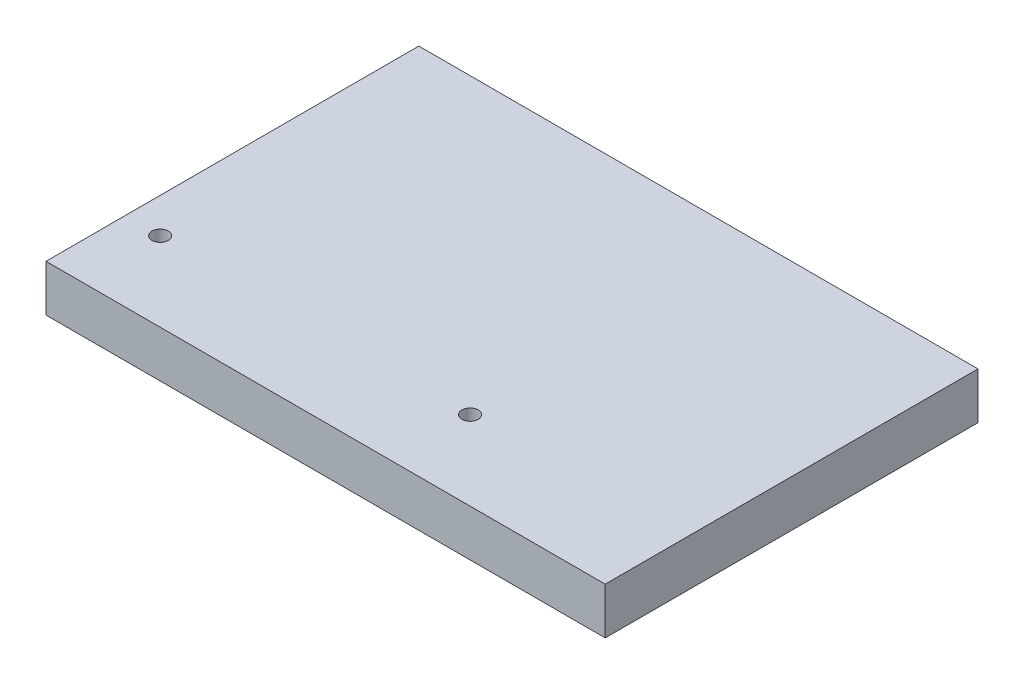
ISO-10303-21;
HEADER;
FILE_DESCRIPTION(('STEP AP214'),'2;1');
FILE_NAME('part.step','',(''),(''),'','','');
FILE_SCHEMA(('AUTOMOTIVE_DESIGN { 1 0 10303 214 1 1 1 1 }'));
ENDSEC;
DATA;
#1=APPLICATION_CONTEXT('core data for automotive mechanical design processes');
#2=APPLICATION_PROTOCOL_DEFINITION('international standard','automotive_design',2000,#1);
#3=PRODUCT_CONTEXT('',#1,'mechanical');
#4=PRODUCT('Part','Part','',(#3));
#5=PRODUCT_RELATED_PRODUCT_CATEGORY('part','',(#4));
#6=PRODUCT_DEFINITION_FORMATION('','',#4);
#7=PRODUCT_DEFINITION_CONTEXT('part definition',#1,'design');
#8=PRODUCT_DEFINITION('design','',#6,#7);
#9=PRODUCT_DEFINITION_SHAPE('','',#8);
#10=(LENGTH_UNIT() NAMED_UNIT(*) SI_UNIT(.MILLI.,.METRE.));
#11=(NAMED_UNIT(*) PLANE_ANGLE_UNIT() SI_UNIT($,.RADIAN.));
#12=(NAMED_UNIT(*) SI_UNIT($,.STERADIAN.) SOLID_ANGLE_UNIT());
#13=UNCERTAINTY_MEASURE_WITH_UNIT(LENGTH_MEASURE(1.E-05),#10,'distance_accuracy_value','');
#14=(GEOMETRIC_REPRESENTATION_CONTEXT(3) GLOBAL_UNCERTAINTY_ASSIGNED_CONTEXT((#13)) GLOBAL_UNIT_ASSIGNED_CONTEXT((#10,
#11,#12)) REPRESENTATION_CONTEXT('',''));
#15=CARTESIAN_POINT('',(0.,0.,0.));
#16=DIRECTION('',(0.,0.,1.));
#17=DIRECTION('',(1.,0.,0.));
#18=AXIS2_PLACEMENT_3D('',#15,#16,#17);
#19=CARTESIAN_POINT('',(-12.4894600922342,5100.00000000001,9.92126427003307));
#20=DIRECTION('',(0.,-1.,0.));
#21=DIRECTION('',(0.,0.,-1.));
#22=AXIS2_PLACEMENT_3D('',#19,#20,#21);
#23=CYLINDRICAL_SURFACE('',#22,1.75);
#24=CARTESIAN_POINT('',(-12.4894600922342,5100.00000000001,9.92126427003307));
#25=DIRECTION('',(0.,-1.,0.));
#26=DIRECTION('',(0.,0.,-1.));
#27=AXIS2_PLACEMENT_3D('',#24,#25,#26);
#28=CIRCLE('',#27,1.75);
#29=CARTESIAN_POINT('',(-12.4894600922342,5100.00000000001,8.17126427003307));
#30=VERTEX_POINT('',#29);
#31=EDGE_CURVE('E110',#30,#30,#28,.T.);
#32=ORIENTED_EDGE('',*,*,#31,.F.);
#33=EDGE_LOOP('',(#32));
#34=FACE_BOUND('',#33,.T.);
#35=CARTESIAN_POINT('',(-12.4894600922342,5095.00000000001,9.92126427003307));
#36=DIRECTION('',(0.,-1.,0.));
#37=DIRECTION('',(0.,0.,-1.));
#38=AXIS2_PLACEMENT_3D('',#35,#36,#37);
#39=CIRCLE('',#38,1.75);
#40=CARTESIAN_POINT('',(-12.4894600922342,5095.00000000001,8.17126427003307));
#41=VERTEX_POINT('',#40);
#42=EDGE_CURVE('E37',#41,#41,#39,.F.);
#43=ORIENTED_EDGE('',*,*,#42,.F.);
#44=EDGE_LOOP('',(#43));
#45=FACE_BOUND('',#44,.T.);
#46=ADVANCED_FACE('F33',(#34,#45),#23,.F.);
#47=CARTESIAN_POINT('',(-78.9894600922342,5100.00000000001,9.92126427003307));
#48=DIRECTION('',(0.,-1.,0.));
#49=DIRECTION('',(0.,0.,-1.));
#50=AXIS2_PLACEMENT_3D('',#47,#48,#49);
#51=CYLINDRICAL_SURFACE('',#50,1.75);
#52=CARTESIAN_POINT('',(-78.9894600922342,5100.00000000001,9.92126427003307));
#53=DIRECTION('',(0.,-1.,0.));
#54=DIRECTION('',(0.,0.,-1.));
#55=AXIS2_PLACEMENT_3D('',#52,#53,#54);
#56=CIRCLE('',#55,1.75);
#57=CARTESIAN_POINT('',(-78.9894600922342,5100.00000000001,8.17126427003307));
#58=VERTEX_POINT('',#57);
#59=EDGE_CURVE('E103',#58,#58,#56,.T.);
#60=ORIENTED_EDGE('',*,*,#59,.F.);
#61=EDGE_LOOP('',(#60));
#62=FACE_BOUND('',#61,.T.);
#63=CARTESIAN_POINT('',(-78.9894600922342,5095.00000000001,9.92126427003307));
#64=DIRECTION('',(0.,-1.,0.));
#65=DIRECTION('',(0.,0.,-1.));
#66=AXIS2_PLACEMENT_3D('',#63,#64,#65);
#67=CIRCLE('',#66,1.75);
#68=CARTESIAN_POINT('',(-78.9894600922342,5095.00000000001,8.17126427003307));
#69=VERTEX_POINT('',#68);
#70=EDGE_CURVE('E108',#69,#69,#67,.F.);
#71=ORIENTED_EDGE('',*,*,#70,.F.);
#72=EDGE_LOOP('',(#71));
#73=FACE_BOUND('',#72,.T.);
#74=ADVANCED_FACE('F133',(#62,#73),#51,.F.);
#75=CARTESIAN_POINT('',(-86.4894600922342,5090.00000000001,26.9212642700331));
#76=DIRECTION('',(1.,0.,0.));
#77=DIRECTION('',(0.,0.,-1.));
#78=AXIS2_PLACEMENT_3D('',#75,#76,#77);
#79=PLANE('',#78);
#80=DIRECTION('',(0.,0.,-1.));
#81=VECTOR('',#80,1.);
#82=CARTESIAN_POINT('',(-86.4894600922342,5100.00000000001,26.9212642700331));
#83=LINE('',#82,#81);
#84=CARTESIAN_POINT('',(-86.4894600922342,5100.00000000001,26.9212642700331));
#85=VERTEX_POINT('',#84);
#86=CARTESIAN_POINT('',(-86.4894600922342,5100.00000000001,-53.0787357299669));
#87=VERTEX_POINT('',#86);
#88=EDGE_CURVE('E100',#85,#87,#83,.T.);
#89=ORIENTED_EDGE('',*,*,#88,.T.);
#90=DIRECTION('',(0.,1.,0.));
#91=VECTOR('',#90,1.);
#92=CARTESIAN_POINT('',(-86.4894600922342,5090.00000000001,-53.0787357299669));
#93=LINE('',#92,#91);
#94=CARTESIAN_POINT('',(-86.4894600922342,5090.00000000001,-53.0787357299669));
#95=VERTEX_POINT('',#94);
#96=EDGE_CURVE('E11',#95,#87,#93,.T.);
#97=ORIENTED_EDGE('',*,*,#96,.F.);
#98=DIRECTION('',(0.,0.,-1.));
#99=VECTOR('',#98,1.);
#100=CARTESIAN_POINT('',(-86.4894600922342,5090.00000000001,26.9212642700331));
#101=LINE('',#100,#99);
#102=CARTESIAN_POINT('',(-86.4894600922342,5090.00000000001,26.9212642700331));
#103=VERTEX_POINT('',#102);
#104=EDGE_CURVE('E87',#103,#95,#101,.T.);
#105=ORIENTED_EDGE('',*,*,#104,.F.);
#106=DIRECTION('',(0.,1.,0.));
#107=VECTOR('',#106,1.);
#108=CARTESIAN_POINT('',(-86.4894600922342,5090.00000000001,26.9212642700331));
#109=LINE('',#108,#107);
#110=EDGE_CURVE('E96',#103,#85,#109,.T.);
#111=ORIENTED_EDGE('',*,*,#110,.T.);
#112=EDGE_LOOP('',(#89,#97,#105,#111));
#113=FACE_BOUND('',#112,.T.);
#114=ADVANCED_FACE('F35',(#113),#79,.F.);
#115=CARTESIAN_POINT('',(-86.4894600922342,5090.00000000001,-53.0787357299669));
#116=DIRECTION('',(0.,0.,1.));
#117=DIRECTION('',(1.,0.,0.));
#118=AXIS2_PLACEMENT_3D('',#115,#116,#117);
#119=PLANE('',#118);
#120=DIRECTION('',(1.,0.,0.));
#121=VECTOR('',#120,1.);
#122=CARTESIAN_POINT('',(-86.4894600922342,5100.00000000001,-53.0787357299669));
#123=LINE('',#122,#121);
#124=CARTESIAN_POINT('',(33.5105399077658,5100.00000000001,-53.0787357299669));
#125=VERTEX_POINT('',#124);
#126=EDGE_CURVE('E91',#87,#125,#123,.T.);
#127=ORIENTED_EDGE('',*,*,#126,.T.);
#128=DIRECTION('',(0.,1.,0.));
#129=VECTOR('',#128,1.);
#130=CARTESIAN_POINT('',(33.5105399077658,5090.00000000001,-53.0787357299669));
#131=LINE('',#130,#129);
#132=CARTESIAN_POINT('',(33.5105399077658,5090.00000000001,-53.0787357299669));
#133=VERTEX_POINT('',#132);
#134=EDGE_CURVE('E43',#133,#125,#131,.T.);
#135=ORIENTED_EDGE('',*,*,#134,.F.);
#136=DIRECTION('',(1.,0.,0.));
#137=VECTOR('',#136,1.);
#138=CARTESIAN_POINT('',(-86.4894600922342,5090.00000000001,-53.0787357299669));
#139=LINE('',#138,#137);
#140=EDGE_CURVE('E82',#95,#133,#139,.T.);
#141=ORIENTED_EDGE('',*,*,#140,.F.);
#142=ORIENTED_EDGE('',*,*,#96,.T.);
#143=EDGE_LOOP('',(#127,#135,#141,#142));
#144=FACE_BOUND('',#143,.T.);
#145=ADVANCED_FACE('F90',(#144),#119,.F.);
#146=CARTESIAN_POINT('',(33.5105399077658,5090.00000000001,26.9212642700331));
#147=DIRECTION('',(-1.,0.,0.));
#148=DIRECTION('',(0.,0.,1.));
#149=AXIS2_PLACEMENT_3D('',#146,#147,#148);
#150=PLANE('',#149);
#151=DIRECTION('',(0.,0.,1.));
#152=VECTOR('',#151,1.);
#153=CARTESIAN_POINT('',(33.5105399077658,5100.00000000001,26.9212642700331));
#154=LINE('',#153,#152);
#155=CARTESIAN_POINT('',(33.5105399077658,5100.00000000001,26.9212642700331));
#156=VERTEX_POINT('',#155);
#157=EDGE_CURVE('E69',#125,#156,#154,.T.);
#158=ORIENTED_EDGE('',*,*,#157,.T.);
#159=DIRECTION('',(0.,1.,0.));
#160=VECTOR('',#159,1.);
#161=CARTESIAN_POINT('',(33.5105399077658,5090.00000000001,26.9212642700331));
#162=LINE('',#161,#160);
#163=CARTESIAN_POINT('',(33.5105399077658,5090.00000000001,26.9212642700331));
#164=VERTEX_POINT('',#163);
#165=EDGE_CURVE('E92',#164,#156,#162,.T.);
#166=ORIENTED_EDGE('',*,*,#165,.F.);
#167=DIRECTION('',(0.,0.,1.));
#168=VECTOR('',#167,1.);
#169=CARTESIAN_POINT('',(33.5105399077658,5090.00000000001,26.9212642700331));
#170=LINE('',#169,#168);
#171=EDGE_CURVE('E85',#133,#164,#170,.T.);
#172=ORIENTED_EDGE('',*,*,#171,.F.);
#173=ORIENTED_EDGE('',*,*,#134,.T.);
#174=EDGE_LOOP('',(#158,#166,#172,#173));
#175=FACE_BOUND('',#174,.T.);
#176=ADVANCED_FACE('F94',(#175),#150,.F.);
#177=CARTESIAN_POINT('',(-86.4894600922342,5090.00000000001,26.9212642700331));
#178=DIRECTION('',(0.,0.,-1.));
#179=DIRECTION('',(-1.,0.,0.));
#180=AXIS2_PLACEMENT_3D('',#177,#178,#179);
#181=PLANE('',#180);
#182=DIRECTION('',(-1.,0.,0.));
#183=VECTOR('',#182,1.);
#184=CARTESIAN_POINT('',(-86.4894600922342,5100.00000000001,26.9212642700331));
#185=LINE('',#184,#183);
#186=EDGE_CURVE('E75',#156,#85,#185,.T.);
#187=ORIENTED_EDGE('',*,*,#186,.T.);
#188=ORIENTED_EDGE('',*,*,#110,.F.);
#189=DIRECTION('',(-1.,0.,0.));
#190=VECTOR('',#189,1.);
#191=CARTESIAN_POINT('',(-86.4894600922342,5090.00000000001,26.9212642700331));
#192=LINE('',#191,#190);
#193=EDGE_CURVE('E52',#164,#103,#192,.T.);
#194=ORIENTED_EDGE('',*,*,#193,.F.);
#195=ORIENTED_EDGE('',*,*,#165,.T.);
#196=EDGE_LOOP('',(#187,#188,#194,#195));
#197=FACE_BOUND('',#196,.T.);
#198=ADVANCED_FACE('F149',(#197),#181,.F.);
#199=CARTESIAN_POINT('',(-86.4894600922342,5090.00000000001,-53.0787357299669));
#200=DIRECTION('',(0.,-1.,0.));
#201=DIRECTION('',(0.,0.,-1.));
#202=AXIS2_PLACEMENT_3D('',#199,#200,#201);
#203=PLANE('',#202);
#204=CARTESIAN_POINT('',(-12.4894600922342,5090.00000000001,9.92126427003307));
#205=DIRECTION('',(0.,-1.,0.));
#206=DIRECTION('',(0.,0.,-1.));
#207=AXIS2_PLACEMENT_3D('',#204,#205,#206);
#208=CIRCLE('',#207,3.25);
#209=CARTESIAN_POINT('',(-12.4894600922342,5090.00000000001,6.67126427003307));
#210=VERTEX_POINT('',#209);
#211=EDGE_CURVE('E124',#210,#210,#208,.T.);
#212=ORIENTED_EDGE('',*,*,#211,.F.);
#213=EDGE_LOOP('',(#212));
#214=FACE_BOUND('',#213,.T.);
#215=CARTESIAN_POINT('',(-78.9894600922342,5090.00000000001,9.92126427003307));
#216=DIRECTION('',(0.,-1.,0.));
#217=DIRECTION('',(0.,0.,-1.));
#218=AXIS2_PLACEMENT_3D('',#215,#216,#217);
#219=CIRCLE('',#218,3.25000000000001);
#220=CARTESIAN_POINT('',(-78.9894600922342,5090.00000000001,6.67126427003306));
#221=VERTEX_POINT('',#220);
#222=EDGE_CURVE('E117',#221,#221,#219,.T.);
#223=ORIENTED_EDGE('',*,*,#222,.F.);
#224=EDGE_LOOP('',(#223));
#225=FACE_BOUND('',#224,.T.);
#226=ORIENTED_EDGE('',*,*,#104,.T.);
#227=ORIENTED_EDGE('',*,*,#140,.T.);
#228=ORIENTED_EDGE('',*,*,#171,.T.);
#229=ORIENTED_EDGE('',*,*,#193,.T.);
#230=EDGE_LOOP('',(#226,#227,#228,#229));
#231=FACE_BOUND('',#230,.T.);
#232=ADVANCED_FACE('F83',(#214,#225,#231),#203,.T.);
#233=CARTESIAN_POINT('',(-86.4894600922342,5100.00000000001,-53.0787357299669));
#234=DIRECTION('',(0.,-1.,0.));
#235=DIRECTION('',(0.,0.,-1.));
#236=AXIS2_PLACEMENT_3D('',#233,#234,#235);
#237=PLANE('',#236);
#238=ORIENTED_EDGE('',*,*,#31,.T.);
#239=EDGE_LOOP('',(#238));
#240=FACE_BOUND('',#239,.T.);
#241=ORIENTED_EDGE('',*,*,#59,.T.);
#242=EDGE_LOOP('',(#241));
#243=FACE_BOUND('',#242,.T.);
#244=ORIENTED_EDGE('',*,*,#88,.F.);
#245=ORIENTED_EDGE('',*,*,#186,.F.);
#246=ORIENTED_EDGE('',*,*,#157,.F.);
#247=ORIENTED_EDGE('',*,*,#126,.F.);
#248=EDGE_LOOP('',(#244,#245,#246,#247));
#249=FACE_BOUND('',#248,.T.);
#250=ADVANCED_FACE('F130',(#240,#243,#249),#237,.F.);
#251=CARTESIAN_POINT('',(-78.9894600922342,5095.00000000001,9.92126427003307));
#252=DIRECTION('',(0.,-1.,0.));
#253=DIRECTION('',(0.,0.,-1.));
#254=AXIS2_PLACEMENT_3D('',#251,#252,#253);
#255=PLANE('',#254);
#256=CARTESIAN_POINT('',(-78.9894600922342,5095.00000000001,9.92126427003307));
#257=DIRECTION('',(0.,-1.,0.));
#258=DIRECTION('',(0.,0.,-1.));
#259=AXIS2_PLACEMENT_3D('',#256,#257,#258);
#260=CIRCLE('',#259,3.25000000000001);
#261=CARTESIAN_POINT('',(-78.9894600922342,5095.00000000001,6.67126427003306));
#262=VERTEX_POINT('',#261);
#263=EDGE_CURVE('E111',#262,#262,#260,.T.);
#264=ORIENTED_EDGE('',*,*,#263,.T.);
#265=EDGE_LOOP('',(#264));
#266=FACE_BOUND('',#265,.T.);
#267=ORIENTED_EDGE('',*,*,#70,.T.);
#268=EDGE_LOOP('',(#267));
#269=FACE_BOUND('',#268,.T.);
#270=ADVANCED_FACE('F153',(#266,#269),#255,.T.);
#271=CARTESIAN_POINT('',(-78.9894600922342,5095.00000000001,9.92126427003307));
#272=DIRECTION('',(0.,-1.,0.));
#273=DIRECTION('',(0.,0.,-1.));
#274=AXIS2_PLACEMENT_3D('',#271,#272,#273);
#275=CYLINDRICAL_SURFACE('',#274,3.25000000000001);
#276=ORIENTED_EDGE('',*,*,#263,.F.);
#277=EDGE_LOOP('',(#276));
#278=FACE_BOUND('',#277,.T.);
#279=ORIENTED_EDGE('',*,*,#222,.T.);
#280=EDGE_LOOP('',(#279));
#281=FACE_BOUND('',#280,.T.);
#282=ADVANCED_FACE('F200',(#278,#281),#275,.F.);
#283=CARTESIAN_POINT('',(-12.4894600922342,5095.00000000001,9.92126427003307));
#284=DIRECTION('',(0.,-1.,0.));
#285=DIRECTION('',(0.,0.,-1.));
#286=AXIS2_PLACEMENT_3D('',#283,#284,#285);
#287=PLANE('',#286);
#288=CARTESIAN_POINT('',(-12.4894600922342,5095.00000000001,9.92126427003307));
#289=DIRECTION('',(0.,-1.,0.));
#290=DIRECTION('',(0.,0.,-1.));
#291=AXIS2_PLACEMENT_3D('',#288,#289,#290);
#292=CIRCLE('',#291,3.25);
#293=CARTESIAN_POINT('',(-12.4894600922342,5095.00000000001,6.67126427003307));
#294=VERTEX_POINT('',#293);
#295=EDGE_CURVE('E234',#294,#294,#292,.T.);
#296=ORIENTED_EDGE('',*,*,#295,.T.);
#297=EDGE_LOOP('',(#296));
#298=FACE_BOUND('',#297,.T.);
#299=ORIENTED_EDGE('',*,*,#42,.T.);
#300=EDGE_LOOP('',(#299));
#301=FACE_BOUND('',#300,.T.);
#302=ADVANCED_FACE('F208',(#298,#301),#287,.T.);
#303=CARTESIAN_POINT('',(-12.4894600922342,5095.00000000001,9.92126427003307));
#304=DIRECTION('',(0.,-1.,0.));
#305=DIRECTION('',(0.,0.,-1.));
#306=AXIS2_PLACEMENT_3D('',#303,#304,#305);
#307=CYLINDRICAL_SURFACE('',#306,3.25);
#308=ORIENTED_EDGE('',*,*,#295,.F.);
#309=EDGE_LOOP('',(#308));
#310=FACE_BOUND('',#309,.T.);
#311=ORIENTED_EDGE('',*,*,#211,.T.);
#312=EDGE_LOOP('',(#311));
#313=FACE_BOUND('',#312,.T.);
#314=ADVANCED_FACE('F216',(#310,#313),#307,.F.);
#315=CLOSED_SHELL('',(#46,#74,#114,#145,#176,#198,#232,#250,#270,#282,#302,#314));
#316=MANIFOLD_SOLID_BREP('B2',#315);
#317=ADVANCED_BREP_SHAPE_REPRESENTATION('',(#18,#316),#14);
#318=SHAPE_DEFINITION_REPRESENTATION(#9,#317);
ENDSEC;
END-ISO-10303-21;
